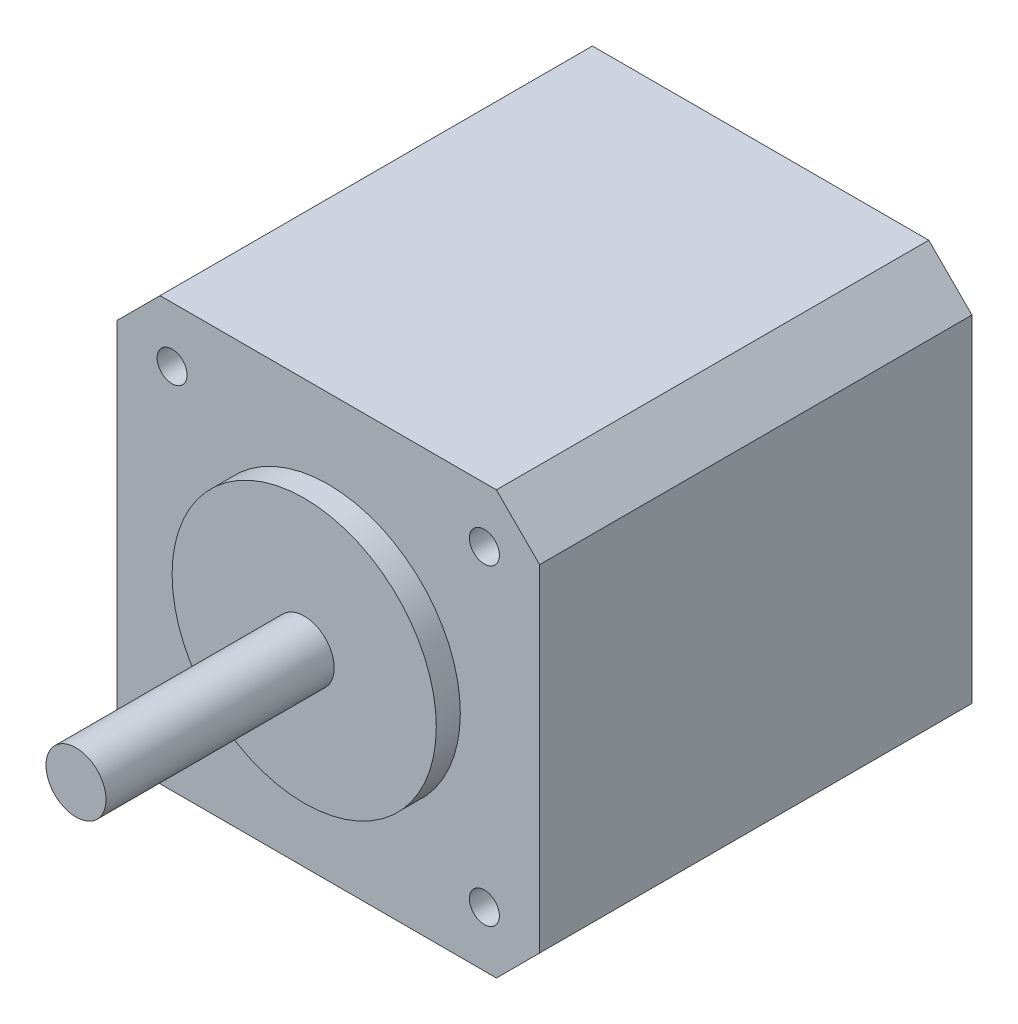
ISO-10303-21;
HEADER;
FILE_DESCRIPTION(('STEP AP214'),'2;1');
FILE_NAME('part.step','',(''),(''),'','','');
FILE_SCHEMA(('AUTOMOTIVE_DESIGN { 1 0 10303 214 1 1 1 1 }'));
ENDSEC;
DATA;
#1=APPLICATION_CONTEXT('core data for automotive mechanical design processes');
#2=APPLICATION_PROTOCOL_DEFINITION('international standard','automotive_design',2000,#1);
#3=PRODUCT_CONTEXT('',#1,'mechanical');
#4=PRODUCT('Part','Part','',(#3));
#5=PRODUCT_RELATED_PRODUCT_CATEGORY('part','',(#4));
#6=PRODUCT_DEFINITION_FORMATION('','',#4);
#7=PRODUCT_DEFINITION_CONTEXT('part definition',#1,'design');
#8=PRODUCT_DEFINITION('design','',#6,#7);
#9=PRODUCT_DEFINITION_SHAPE('','',#8);
#10=(LENGTH_UNIT() NAMED_UNIT(*) SI_UNIT(.MILLI.,.METRE.));
#11=(NAMED_UNIT(*) PLANE_ANGLE_UNIT() SI_UNIT($,.RADIAN.));
#12=(NAMED_UNIT(*) SI_UNIT($,.STERADIAN.) SOLID_ANGLE_UNIT());
#13=UNCERTAINTY_MEASURE_WITH_UNIT(LENGTH_MEASURE(1.E-05),#10,'distance_accuracy_value','');
#14=(GEOMETRIC_REPRESENTATION_CONTEXT(3) GLOBAL_UNCERTAINTY_ASSIGNED_CONTEXT((#13)) GLOBAL_UNIT_ASSIGNED_CONTEXT((#10,
#11,#12)) REPRESENTATION_CONTEXT('',''));
#15=CARTESIAN_POINT('',(0.,0.,0.));
#16=DIRECTION('',(0.,0.,1.));
#17=DIRECTION('',(1.,0.,0.));
#18=AXIS2_PLACEMENT_3D('',#15,#16,#17);
#19=CARTESIAN_POINT('',(0.,0.,2.));
#20=DIRECTION('',(0.,0.,1.));
#21=DIRECTION('',(1.,0.,0.));
#22=AXIS2_PLACEMENT_3D('',#19,#20,#21);
#23=PLANE('',#22);
#24=CARTESIAN_POINT('',(0.,0.,2.));
#25=DIRECTION('',(0.,0.,1.));
#26=DIRECTION('',(1.,0.,0.));
#27=AXIS2_PLACEMENT_3D('',#24,#25,#26);
#28=CIRCLE('',#27,11.);
#29=CARTESIAN_POINT('',(11.,0.,2.));
#30=VERTEX_POINT('',#29);
#31=EDGE_CURVE('E145',#30,#30,#28,.T.);
#32=ORIENTED_EDGE('',*,*,#31,.T.);
#33=EDGE_LOOP('',(#32));
#34=FACE_BOUND('',#33,.T.);
#35=CARTESIAN_POINT('',(0.,0.,2.));
#36=DIRECTION('',(0.,0.,1.));
#37=DIRECTION('',(1.,0.,0.));
#38=AXIS2_PLACEMENT_3D('',#35,#36,#37);
#39=CIRCLE('',#38,2.5);
#40=CARTESIAN_POINT('',(2.5,0.,2.));
#41=VERTEX_POINT('',#40);
#42=EDGE_CURVE('E42',#41,#41,#39,.F.);
#43=ORIENTED_EDGE('',*,*,#42,.T.);
#44=EDGE_LOOP('',(#43));
#45=FACE_BOUND('',#44,.T.);
#46=ADVANCED_FACE('F38',(#34,#45),#23,.T.);
#47=CARTESIAN_POINT('',(0.,0.,0.));
#48=DIRECTION('',(0.,0.,-1.));
#49=DIRECTION('',(-1.,0.,0.));
#50=AXIS2_PLACEMENT_3D('',#47,#48,#49);
#51=PLANE('',#50);
#52=CARTESIAN_POINT('',(-13.,-13.,0.));
#53=DIRECTION('',(0.,0.,1.));
#54=DIRECTION('',(1.,0.,0.));
#55=AXIS2_PLACEMENT_3D('',#52,#53,#54);
#56=CIRCLE('',#55,1.24999999999999);
#57=CARTESIAN_POINT('',(-11.75,-13.,0.));
#58=VERTEX_POINT('',#57);
#59=EDGE_CURVE('E387',#58,#58,#56,.T.);
#60=ORIENTED_EDGE('',*,*,#59,.F.);
#61=EDGE_LOOP('',(#60));
#62=FACE_BOUND('',#61,.T.);
#63=CARTESIAN_POINT('',(13.,-13.,0.));
#64=DIRECTION('',(0.,0.,1.));
#65=DIRECTION('',(1.,0.,0.));
#66=AXIS2_PLACEMENT_3D('',#63,#64,#65);
#67=CIRCLE('',#66,1.24999999999999);
#68=CARTESIAN_POINT('',(14.25,-13.,0.));
#69=VERTEX_POINT('',#68);
#70=EDGE_CURVE('E389',#69,#69,#67,.T.);
#71=ORIENTED_EDGE('',*,*,#70,.F.);
#72=EDGE_LOOP('',(#71));
#73=FACE_BOUND('',#72,.T.);
#74=CARTESIAN_POINT('',(13.,13.,0.));
#75=DIRECTION('',(0.,0.,1.));
#76=DIRECTION('',(1.,0.,0.));
#77=AXIS2_PLACEMENT_3D('',#74,#75,#76);
#78=CIRCLE('',#77,1.24999999999999);
#79=CARTESIAN_POINT('',(14.25,13.,0.));
#80=VERTEX_POINT('',#79);
#81=EDGE_CURVE('E397',#80,#80,#78,.T.);
#82=ORIENTED_EDGE('',*,*,#81,.F.);
#83=EDGE_LOOP('',(#82));
#84=FACE_BOUND('',#83,.T.);
#85=CARTESIAN_POINT('',(-13.,13.,0.));
#86=DIRECTION('',(0.,0.,1.));
#87=DIRECTION('',(1.,0.,0.));
#88=AXIS2_PLACEMENT_3D('',#85,#86,#87);
#89=CIRCLE('',#88,1.24999999999999);
#90=CARTESIAN_POINT('',(-11.75,13.,0.));
#91=VERTEX_POINT('',#90);
#92=EDGE_CURVE('E403',#91,#91,#89,.T.);
#93=ORIENTED_EDGE('',*,*,#92,.F.);
#94=EDGE_LOOP('',(#93));
#95=FACE_BOUND('',#94,.T.);
#96=DIRECTION('',(-0.707106781186551,-0.707106781186544,0.));
#97=VECTOR('',#96,1.);
#98=CARTESIAN_POINT('',(-14.0038057516332,17.6,0.));
#99=LINE('',#98,#97);
#100=CARTESIAN_POINT('',(-14.0038057516332,17.6,0.));
#101=VERTEX_POINT('',#100);
#102=CARTESIAN_POINT('',(-17.6,14.0038057516332,0.));
#103=VERTEX_POINT('',#102);
#104=EDGE_CURVE('E141',#101,#103,#99,.T.);
#105=ORIENTED_EDGE('',*,*,#104,.T.);
#106=DIRECTION('',(0.,-1.,0.));
#107=VECTOR('',#106,1.);
#108=CARTESIAN_POINT('',(-17.6,-14.0038057516332,0.));
#109=LINE('',#108,#107);
#110=CARTESIAN_POINT('',(-17.6,-14.0038057516332,0.));
#111=VERTEX_POINT('',#110);
#112=EDGE_CURVE('E144',#103,#111,#109,.T.);
#113=ORIENTED_EDGE('',*,*,#112,.T.);
#114=DIRECTION('',(0.707106781186547,-0.707106781186548,0.));
#115=VECTOR('',#114,1.);
#116=CARTESIAN_POINT('',(-14.0038057516332,-17.6,0.));
#117=LINE('',#116,#115);
#118=CARTESIAN_POINT('',(-14.0038057516332,-17.6,0.));
#119=VERTEX_POINT('',#118);
#120=EDGE_CURVE('E148',#111,#119,#117,.T.);
#121=ORIENTED_EDGE('',*,*,#120,.T.);
#122=DIRECTION('',(1.,0.,0.));
#123=VECTOR('',#122,1.);
#124=CARTESIAN_POINT('',(-14.0038057516332,-17.6,0.));
#125=LINE('',#124,#123);
#126=CARTESIAN_POINT('',(14.0038057516332,-17.6,0.));
#127=VERTEX_POINT('',#126);
#128=EDGE_CURVE('E151',#119,#127,#125,.T.);
#129=ORIENTED_EDGE('',*,*,#128,.T.);
#130=DIRECTION('',(0.707106781186549,0.707106781186546,0.));
#131=VECTOR('',#130,1.);
#132=CARTESIAN_POINT('',(14.0038057516332,-17.6,0.));
#133=LINE('',#132,#131);
#134=CARTESIAN_POINT('',(17.6,-14.0038057516332,0.));
#135=VERTEX_POINT('',#134);
#136=EDGE_CURVE('E154',#127,#135,#133,.T.);
#137=ORIENTED_EDGE('',*,*,#136,.T.);
#138=DIRECTION('',(0.,1.,0.));
#139=VECTOR('',#138,1.);
#140=CARTESIAN_POINT('',(17.6,-14.0038057516332,0.));
#141=LINE('',#140,#139);
#142=CARTESIAN_POINT('',(17.6,14.0038057516332,0.));
#143=VERTEX_POINT('',#142);
#144=EDGE_CURVE('E157',#135,#143,#141,.T.);
#145=ORIENTED_EDGE('',*,*,#144,.T.);
#146=DIRECTION('',(-0.707106781186548,0.707106781186547,0.));
#147=VECTOR('',#146,1.);
#148=CARTESIAN_POINT('',(14.0038057516332,17.6,0.));
#149=LINE('',#148,#147);
#150=CARTESIAN_POINT('',(14.0038057516332,17.6,0.));
#151=VERTEX_POINT('',#150);
#152=EDGE_CURVE('E118',#143,#151,#149,.T.);
#153=ORIENTED_EDGE('',*,*,#152,.T.);
#154=DIRECTION('',(-1.,0.,0.));
#155=VECTOR('',#154,1.);
#156=CARTESIAN_POINT('',(-14.0038057516332,17.6,0.));
#157=LINE('',#156,#155);
#158=EDGE_CURVE('E160',#151,#101,#157,.T.);
#159=ORIENTED_EDGE('',*,*,#158,.T.);
#160=EDGE_LOOP('',(#105,#113,#121,#129,#137,#145,#153,#159));
#161=FACE_BOUND('',#160,.T.);
#162=CARTESIAN_POINT('',(0.,0.,0.));
#163=DIRECTION('',(0.,0.,-1.));
#164=DIRECTION('',(-1.,0.,0.));
#165=AXIS2_PLACEMENT_3D('',#162,#163,#164);
#166=CIRCLE('',#165,11.);
#167=CARTESIAN_POINT('',(-11.,0.,0.));
#168=VERTEX_POINT('',#167);
#169=EDGE_CURVE('E11',#168,#168,#166,.F.);
#170=ORIENTED_EDGE('',*,*,#169,.F.);
#171=EDGE_LOOP('',(#170));
#172=FACE_BOUND('',#171,.T.);
#173=ADVANCED_FACE('F176',(#62,#73,#84,#95,#161,#172),#51,.F.);
#174=CARTESIAN_POINT('',(-14.0038057516332,17.6,-36.));
#175=DIRECTION('',(-0.707106781186544,0.707106781186551,0.));
#176=DIRECTION('',(-0.707106781186551,-0.707106781186544,0.));
#177=AXIS2_PLACEMENT_3D('',#174,#175,#176);
#178=PLANE('',#177);
#179=ORIENTED_EDGE('',*,*,#104,.F.);
#180=DIRECTION('',(0.,0.,1.));
#181=VECTOR('',#180,1.);
#182=CARTESIAN_POINT('',(-14.0038057516332,17.6,-36.));
#183=LINE('',#182,#181);
#184=CARTESIAN_POINT('',(-14.0038057516332,17.6,-36.));
#185=VERTEX_POINT('',#184);
#186=EDGE_CURVE('E48',#185,#101,#183,.T.);
#187=ORIENTED_EDGE('',*,*,#186,.F.);
#188=DIRECTION('',(-0.707106781186551,-0.707106781186544,0.));
#189=VECTOR('',#188,1.);
#190=CARTESIAN_POINT('',(-14.0038057516332,17.6,-36.));
#191=LINE('',#190,#189);
#192=CARTESIAN_POINT('',(-17.6,14.0038057516332,-36.));
#193=VERTEX_POINT('',#192);
#194=EDGE_CURVE('E163',#185,#193,#191,.T.);
#195=ORIENTED_EDGE('',*,*,#194,.T.);
#196=DIRECTION('',(0.,0.,1.));
#197=VECTOR('',#196,1.);
#198=CARTESIAN_POINT('',(-17.6,14.0038057516332,-36.));
#199=LINE('',#198,#197);
#200=EDGE_CURVE('E97',#193,#103,#199,.T.);
#201=ORIENTED_EDGE('',*,*,#200,.T.);
#202=EDGE_LOOP('',(#179,#187,#195,#201));
#203=FACE_BOUND('',#202,.T.);
#204=ADVANCED_FACE('F40',(#203),#178,.T.);
#205=CARTESIAN_POINT('',(-14.0038057516332,17.6,-36.));
#206=DIRECTION('',(0.,1.,0.));
#207=DIRECTION('',(-1.,0.,0.));
#208=AXIS2_PLACEMENT_3D('',#205,#206,#207);
#209=PLANE('',#208);
#210=ORIENTED_EDGE('',*,*,#158,.F.);
#211=DIRECTION('',(0.,0.,1.));
#212=VECTOR('',#211,1.);
#213=CARTESIAN_POINT('',(14.0038057516332,17.6,-36.));
#214=LINE('',#213,#212);
#215=CARTESIAN_POINT('',(14.0038057516332,17.6,-36.));
#216=VERTEX_POINT('',#215);
#217=EDGE_CURVE('E85',#216,#151,#214,.T.);
#218=ORIENTED_EDGE('',*,*,#217,.F.);
#219=DIRECTION('',(-1.,0.,0.));
#220=VECTOR('',#219,1.);
#221=CARTESIAN_POINT('',(-14.0038057516332,17.6,-36.));
#222=LINE('',#221,#220);
#223=EDGE_CURVE('E131',#216,#185,#222,.T.);
#224=ORIENTED_EDGE('',*,*,#223,.T.);
#225=ORIENTED_EDGE('',*,*,#186,.T.);
#226=EDGE_LOOP('',(#210,#218,#224,#225));
#227=FACE_BOUND('',#226,.T.);
#228=ADVANCED_FACE('F178',(#227),#209,.T.);
#229=CARTESIAN_POINT('',(14.0038057516332,17.6,-36.));
#230=DIRECTION('',(0.707106781186547,0.707106781186548,0.));
#231=DIRECTION('',(-0.707106781186548,0.707106781186547,0.));
#232=AXIS2_PLACEMENT_3D('',#229,#230,#231);
#233=PLANE('',#232);
#234=ORIENTED_EDGE('',*,*,#152,.F.);
#235=DIRECTION('',(0.,0.,1.));
#236=VECTOR('',#235,1.);
#237=CARTESIAN_POINT('',(17.6,14.0038057516332,-36.));
#238=LINE('',#237,#236);
#239=CARTESIAN_POINT('',(17.6,14.0038057516332,-36.));
#240=VERTEX_POINT('',#239);
#241=EDGE_CURVE('E113',#240,#143,#238,.T.);
#242=ORIENTED_EDGE('',*,*,#241,.F.);
#243=DIRECTION('',(-0.707106781186548,0.707106781186547,0.));
#244=VECTOR('',#243,1.);
#245=CARTESIAN_POINT('',(14.0038057516332,17.6,-36.));
#246=LINE('',#245,#244);
#247=EDGE_CURVE('E116',#240,#216,#246,.T.);
#248=ORIENTED_EDGE('',*,*,#247,.T.);
#249=ORIENTED_EDGE('',*,*,#217,.T.);
#250=EDGE_LOOP('',(#234,#242,#248,#249));
#251=FACE_BOUND('',#250,.T.);
#252=ADVANCED_FACE('F115',(#251),#233,.T.);
#253=CARTESIAN_POINT('',(17.6,-14.0038057516332,-36.));
#254=DIRECTION('',(1.,0.,0.));
#255=DIRECTION('',(0.,1.,0.));
#256=AXIS2_PLACEMENT_3D('',#253,#254,#255);
#257=PLANE('',#256);
#258=ORIENTED_EDGE('',*,*,#144,.F.);
#259=DIRECTION('',(0.,0.,1.));
#260=VECTOR('',#259,1.);
#261=CARTESIAN_POINT('',(17.6,-14.0038057516332,-36.));
#262=LINE('',#261,#260);
#263=CARTESIAN_POINT('',(17.6,-14.0038057516332,-36.));
#264=VERTEX_POINT('',#263);
#265=EDGE_CURVE('E123',#264,#135,#262,.T.);
#266=ORIENTED_EDGE('',*,*,#265,.F.);
#267=DIRECTION('',(0.,1.,0.));
#268=VECTOR('',#267,1.);
#269=CARTESIAN_POINT('',(17.6,-14.0038057516332,-36.));
#270=LINE('',#269,#268);
#271=EDGE_CURVE('E129',#264,#240,#270,.T.);
#272=ORIENTED_EDGE('',*,*,#271,.T.);
#273=ORIENTED_EDGE('',*,*,#241,.T.);
#274=EDGE_LOOP('',(#258,#266,#272,#273));
#275=FACE_BOUND('',#274,.T.);
#276=ADVANCED_FACE('F133',(#275),#257,.T.);
#277=CARTESIAN_POINT('',(14.0038057516332,-17.6,-36.));
#278=DIRECTION('',(0.707106781186546,-0.707106781186549,0.));
#279=DIRECTION('',(0.707106781186549,0.707106781186546,0.));
#280=AXIS2_PLACEMENT_3D('',#277,#278,#279);
#281=PLANE('',#280);
#282=ORIENTED_EDGE('',*,*,#136,.F.);
#283=DIRECTION('',(0.,0.,1.));
#284=VECTOR('',#283,1.);
#285=CARTESIAN_POINT('',(14.0038057516332,-17.6,-36.));
#286=LINE('',#285,#284);
#287=CARTESIAN_POINT('',(14.0038057516332,-17.6,-36.));
#288=VERTEX_POINT('',#287);
#289=EDGE_CURVE('E167',#288,#127,#286,.T.);
#290=ORIENTED_EDGE('',*,*,#289,.F.);
#291=DIRECTION('',(0.707106781186549,0.707106781186546,0.));
#292=VECTOR('',#291,1.);
#293=CARTESIAN_POINT('',(14.0038057516332,-17.6,-36.));
#294=LINE('',#293,#292);
#295=EDGE_CURVE('E134',#288,#264,#294,.T.);
#296=ORIENTED_EDGE('',*,*,#295,.T.);
#297=ORIENTED_EDGE('',*,*,#265,.T.);
#298=EDGE_LOOP('',(#282,#290,#296,#297));
#299=FACE_BOUND('',#298,.T.);
#300=ADVANCED_FACE('F218',(#299),#281,.T.);
#301=CARTESIAN_POINT('',(-14.0038057516332,-17.6,-36.));
#302=DIRECTION('',(0.,-1.,0.));
#303=DIRECTION('',(1.,0.,0.));
#304=AXIS2_PLACEMENT_3D('',#301,#302,#303);
#305=PLANE('',#304);
#306=ORIENTED_EDGE('',*,*,#128,.F.);
#307=DIRECTION('',(0.,0.,1.));
#308=VECTOR('',#307,1.);
#309=CARTESIAN_POINT('',(-14.0038057516332,-17.6,-36.));
#310=LINE('',#309,#308);
#311=CARTESIAN_POINT('',(-14.0038057516332,-17.6,-36.));
#312=VERTEX_POINT('',#311);
#313=EDGE_CURVE('E169',#312,#119,#310,.T.);
#314=ORIENTED_EDGE('',*,*,#313,.F.);
#315=DIRECTION('',(1.,0.,0.));
#316=VECTOR('',#315,1.);
#317=CARTESIAN_POINT('',(-14.0038057516332,-17.6,-36.));
#318=LINE('',#317,#316);
#319=EDGE_CURVE('E136',#312,#288,#318,.T.);
#320=ORIENTED_EDGE('',*,*,#319,.T.);
#321=ORIENTED_EDGE('',*,*,#289,.T.);
#322=EDGE_LOOP('',(#306,#314,#320,#321));
#323=FACE_BOUND('',#322,.T.);
#324=ADVANCED_FACE('F212',(#323),#305,.T.);
#325=CARTESIAN_POINT('',(-14.0038057516332,-17.6,-36.));
#326=DIRECTION('',(-0.707106781186548,-0.707106781186547,0.));
#327=DIRECTION('',(0.707106781186547,-0.707106781186548,0.));
#328=AXIS2_PLACEMENT_3D('',#325,#326,#327);
#329=PLANE('',#328);
#330=ORIENTED_EDGE('',*,*,#120,.F.);
#331=DIRECTION('',(0.,0.,1.));
#332=VECTOR('',#331,1.);
#333=CARTESIAN_POINT('',(-17.6,-14.0038057516332,-36.));
#334=LINE('',#333,#332);
#335=CARTESIAN_POINT('',(-17.6,-14.0038057516332,-36.));
#336=VERTEX_POINT('',#335);
#337=EDGE_CURVE('E171',#336,#111,#334,.T.);
#338=ORIENTED_EDGE('',*,*,#337,.F.);
#339=DIRECTION('',(0.707106781186547,-0.707106781186548,0.));
#340=VECTOR('',#339,1.);
#341=CARTESIAN_POINT('',(-14.0038057516332,-17.6,-36.));
#342=LINE('',#341,#340);
#343=EDGE_CURVE('E416',#336,#312,#342,.T.);
#344=ORIENTED_EDGE('',*,*,#343,.T.);
#345=ORIENTED_EDGE('',*,*,#313,.T.);
#346=EDGE_LOOP('',(#330,#338,#344,#345));
#347=FACE_BOUND('',#346,.T.);
#348=ADVANCED_FACE('F208',(#347),#329,.T.);
#349=CARTESIAN_POINT('',(-17.6,-14.0038057516332,-36.));
#350=DIRECTION('',(-1.,0.,0.));
#351=DIRECTION('',(0.,-1.,0.));
#352=AXIS2_PLACEMENT_3D('',#349,#350,#351);
#353=PLANE('',#352);
#354=ORIENTED_EDGE('',*,*,#112,.F.);
#355=ORIENTED_EDGE('',*,*,#200,.F.);
#356=DIRECTION('',(0.,-1.,0.));
#357=VECTOR('',#356,1.);
#358=CARTESIAN_POINT('',(-17.6,-14.0038057516332,-36.));
#359=LINE('',#358,#357);
#360=EDGE_CURVE('E414',#193,#336,#359,.T.);
#361=ORIENTED_EDGE('',*,*,#360,.T.);
#362=ORIENTED_EDGE('',*,*,#337,.T.);
#363=EDGE_LOOP('',(#354,#355,#361,#362));
#364=FACE_BOUND('',#363,.T.);
#365=ADVANCED_FACE('F173',(#364),#353,.T.);
#366=CARTESIAN_POINT('',(0.,0.,-36.));
#367=DIRECTION('',(0.,0.,-1.));
#368=DIRECTION('',(-1.,0.,0.));
#369=AXIS2_PLACEMENT_3D('',#366,#367,#368);
#370=PLANE('',#369);
#371=ORIENTED_EDGE('',*,*,#194,.F.);
#372=ORIENTED_EDGE('',*,*,#223,.F.);
#373=ORIENTED_EDGE('',*,*,#247,.F.);
#374=ORIENTED_EDGE('',*,*,#271,.F.);
#375=ORIENTED_EDGE('',*,*,#295,.F.);
#376=ORIENTED_EDGE('',*,*,#319,.F.);
#377=ORIENTED_EDGE('',*,*,#343,.F.);
#378=ORIENTED_EDGE('',*,*,#360,.F.);
#379=EDGE_LOOP('',(#371,#372,#373,#374,#375,#376,#377,#378));
#380=FACE_BOUND('',#379,.T.);
#381=ADVANCED_FACE('F127',(#380),#370,.T.);
#382=CARTESIAN_POINT('',(0.,0.,2.));
#383=DIRECTION('',(0.,0.,-1.));
#384=DIRECTION('',(-1.,0.,0.));
#385=AXIS2_PLACEMENT_3D('',#382,#383,#384);
#386=CYLINDRICAL_SURFACE('',#385,11.);
#387=ORIENTED_EDGE('',*,*,#31,.F.);
#388=EDGE_LOOP('',(#387));
#389=FACE_BOUND('',#388,.T.);
#390=ORIENTED_EDGE('',*,*,#169,.T.);
#391=EDGE_LOOP('',(#390));
#392=FACE_BOUND('',#391,.T.);
#393=ADVANCED_FACE('F200',(#389,#392),#386,.T.);
#394=CARTESIAN_POINT('',(0.,0.,21.));
#395=DIRECTION('',(0.,0.,-1.));
#396=DIRECTION('',(-1.,0.,0.));
#397=AXIS2_PLACEMENT_3D('',#394,#395,#396);
#398=CYLINDRICAL_SURFACE('',#397,2.5);
#399=ORIENTED_EDGE('',*,*,#42,.F.);
#400=EDGE_LOOP('',(#399));
#401=FACE_BOUND('',#400,.T.);
#402=CARTESIAN_POINT('',(0.,0.,21.));
#403=DIRECTION('',(0.,0.,1.));
#404=DIRECTION('',(1.,0.,0.));
#405=AXIS2_PLACEMENT_3D('',#402,#403,#404);
#406=CIRCLE('',#405,2.5);
#407=CARTESIAN_POINT('',(2.5,0.,21.));
#408=VERTEX_POINT('',#407);
#409=EDGE_CURVE('E409',#408,#408,#406,.T.);
#410=ORIENTED_EDGE('',*,*,#409,.F.);
#411=EDGE_LOOP('',(#410));
#412=FACE_BOUND('',#411,.T.);
#413=ADVANCED_FACE('F198',(#401,#412),#398,.T.);
#414=CARTESIAN_POINT('',(0.,0.,21.));
#415=DIRECTION('',(0.,0.,1.));
#416=DIRECTION('',(1.,0.,0.));
#417=AXIS2_PLACEMENT_3D('',#414,#415,#416);
#418=PLANE('',#417);
#419=ORIENTED_EDGE('',*,*,#409,.T.);
#420=EDGE_LOOP('',(#419));
#421=FACE_BOUND('',#420,.T.);
#422=ADVANCED_FACE('F268',(#421),#418,.T.);
#423=CARTESIAN_POINT('',(-13.,13.,-5.));
#424=DIRECTION('',(0.,0.,1.));
#425=DIRECTION('',(1.,0.,0.));
#426=AXIS2_PLACEMENT_3D('',#423,#424,#425);
#427=CONICAL_SURFACE('',#426,1.25,1.02974425867665);
#428=CARTESIAN_POINT('',(-13.,13.,-5.75107577378445));
#429=VERTEX_POINT('',#428);
#430=VERTEX_LOOP('',#429);
#431=FACE_BOUND('',#430,.T.);
#432=CARTESIAN_POINT('',(-13.,13.,-5.));
#433=DIRECTION('',(0.,0.,1.));
#434=DIRECTION('',(1.,0.,0.));
#435=AXIS2_PLACEMENT_3D('',#432,#433,#434);
#436=CIRCLE('',#435,1.25);
#437=CARTESIAN_POINT('',(-11.75,13.,-5.));
#438=VERTEX_POINT('',#437);
#439=EDGE_CURVE('E406',#438,#438,#436,.T.);
#440=ORIENTED_EDGE('',*,*,#439,.T.);
#441=EDGE_LOOP('',(#440));
#442=FACE_BOUND('',#441,.T.);
#443=ADVANCED_FACE('F277',(#431,#442),#427,.F.);
#444=CARTESIAN_POINT('',(-13.,13.,0.));
#445=DIRECTION('',(0.,0.,1.));
#446=DIRECTION('',(1.,0.,0.));
#447=AXIS2_PLACEMENT_3D('',#444,#445,#446);
#448=CYLINDRICAL_SURFACE('',#447,1.24999999999999);
#449=ORIENTED_EDGE('',*,*,#439,.F.);
#450=EDGE_LOOP('',(#449));
#451=FACE_BOUND('',#450,.T.);
#452=ORIENTED_EDGE('',*,*,#92,.T.);
#453=EDGE_LOOP('',(#452));
#454=FACE_BOUND('',#453,.T.);
#455=ADVANCED_FACE('F291',(#451,#454),#448,.F.);
#456=CARTESIAN_POINT('',(13.,13.,-5.));
#457=DIRECTION('',(0.,0.,1.));
#458=DIRECTION('',(1.,0.,0.));
#459=AXIS2_PLACEMENT_3D('',#456,#457,#458);
#460=CONICAL_SURFACE('',#459,1.25,1.02974425867665);
#461=CARTESIAN_POINT('',(13.,13.,-5.75107577378445));
#462=VERTEX_POINT('',#461);
#463=VERTEX_LOOP('',#462);
#464=FACE_BOUND('',#463,.T.);
#465=CARTESIAN_POINT('',(13.,13.,-5.));
#466=DIRECTION('',(0.,0.,1.));
#467=DIRECTION('',(1.,0.,0.));
#468=AXIS2_PLACEMENT_3D('',#465,#466,#467);
#469=CIRCLE('',#468,1.25);
#470=CARTESIAN_POINT('',(14.25,13.,-5.));
#471=VERTEX_POINT('',#470);
#472=EDGE_CURVE('E400',#471,#471,#469,.T.);
#473=ORIENTED_EDGE('',*,*,#472,.T.);
#474=EDGE_LOOP('',(#473));
#475=FACE_BOUND('',#474,.T.);
#476=ADVANCED_FACE('F302',(#464,#475),#460,.F.);
#477=CARTESIAN_POINT('',(13.,13.,0.));
#478=DIRECTION('',(0.,0.,1.));
#479=DIRECTION('',(1.,0.,0.));
#480=AXIS2_PLACEMENT_3D('',#477,#478,#479);
#481=CYLINDRICAL_SURFACE('',#480,1.24999999999999);
#482=ORIENTED_EDGE('',*,*,#472,.F.);
#483=EDGE_LOOP('',(#482));
#484=FACE_BOUND('',#483,.T.);
#485=ORIENTED_EDGE('',*,*,#81,.T.);
#486=EDGE_LOOP('',(#485));
#487=FACE_BOUND('',#486,.T.);
#488=ADVANCED_FACE('F314',(#484,#487),#481,.F.);
#489=CARTESIAN_POINT('',(13.,-13.,-5.));
#490=DIRECTION('',(0.,0.,1.));
#491=DIRECTION('',(1.,0.,0.));
#492=AXIS2_PLACEMENT_3D('',#489,#490,#491);
#493=CONICAL_SURFACE('',#492,1.25,1.02974425867665);
#494=CARTESIAN_POINT('',(13.,-13.,-5.75107577378445));
#495=VERTEX_POINT('',#494);
#496=VERTEX_LOOP('',#495);
#497=FACE_BOUND('',#496,.T.);
#498=CARTESIAN_POINT('',(13.,-13.,-5.));
#499=DIRECTION('',(0.,0.,1.));
#500=DIRECTION('',(1.,0.,0.));
#501=AXIS2_PLACEMENT_3D('',#498,#499,#500);
#502=CIRCLE('',#501,1.25);
#503=CARTESIAN_POINT('',(14.25,-13.,-5.));
#504=VERTEX_POINT('',#503);
#505=EDGE_CURVE('E394',#504,#504,#502,.T.);
#506=ORIENTED_EDGE('',*,*,#505,.T.);
#507=EDGE_LOOP('',(#506));
#508=FACE_BOUND('',#507,.T.);
#509=ADVANCED_FACE('F324',(#497,#508),#493,.F.);
#510=CARTESIAN_POINT('',(13.,-13.,0.));
#511=DIRECTION('',(0.,0.,1.));
#512=DIRECTION('',(1.,0.,0.));
#513=AXIS2_PLACEMENT_3D('',#510,#511,#512);
#514=CYLINDRICAL_SURFACE('',#513,1.24999999999999);
#515=ORIENTED_EDGE('',*,*,#505,.F.);
#516=EDGE_LOOP('',(#515));
#517=FACE_BOUND('',#516,.T.);
#518=ORIENTED_EDGE('',*,*,#70,.T.);
#519=EDGE_LOOP('',(#518));
#520=FACE_BOUND('',#519,.T.);
#521=ADVANCED_FACE('F336',(#517,#520),#514,.F.);
#522=CARTESIAN_POINT('',(-13.,-13.,-5.));
#523=DIRECTION('',(0.,0.,1.));
#524=DIRECTION('',(1.,0.,0.));
#525=AXIS2_PLACEMENT_3D('',#522,#523,#524);
#526=CONICAL_SURFACE('',#525,1.25,1.02974425867665);
#527=CARTESIAN_POINT('',(-13.,-13.,-5.75107577378445));
#528=VERTEX_POINT('',#527);
#529=VERTEX_LOOP('',#528);
#530=FACE_BOUND('',#529,.T.);
#531=CARTESIAN_POINT('',(-13.,-13.,-5.));
#532=DIRECTION('',(0.,0.,1.));
#533=DIRECTION('',(1.,0.,0.));
#534=AXIS2_PLACEMENT_3D('',#531,#532,#533);
#535=CIRCLE('',#534,1.25);
#536=CARTESIAN_POINT('',(-11.75,-13.,-5.));
#537=VERTEX_POINT('',#536);
#538=EDGE_CURVE('E384',#537,#537,#535,.T.);
#539=ORIENTED_EDGE('',*,*,#538,.T.);
#540=EDGE_LOOP('',(#539));
#541=FACE_BOUND('',#540,.T.);
#542=ADVANCED_FACE('F346',(#530,#541),#526,.F.);
#543=CARTESIAN_POINT('',(-13.,-13.,0.));
#544=DIRECTION('',(0.,0.,1.));
#545=DIRECTION('',(1.,0.,0.));
#546=AXIS2_PLACEMENT_3D('',#543,#544,#545);
#547=CYLINDRICAL_SURFACE('',#546,1.24999999999999);
#548=ORIENTED_EDGE('',*,*,#538,.F.);
#549=EDGE_LOOP('',(#548));
#550=FACE_BOUND('',#549,.T.);
#551=ORIENTED_EDGE('',*,*,#59,.T.);
#552=EDGE_LOOP('',(#551));
#553=FACE_BOUND('',#552,.T.);
#554=ADVANCED_FACE('F358',(#550,#553),#547,.F.);
#555=CLOSED_SHELL('',(#46,#173,#204,#228,#252,#276,#300,#324,#348,#365,#381,#393,#413,#422,#443,
#455,#476,#488,#509,#521,#542,#554));
#556=MANIFOLD_SOLID_BREP('B2',#555);
#557=ADVANCED_BREP_SHAPE_REPRESENTATION('',(#18,#556),#14);
#558=SHAPE_DEFINITION_REPRESENTATION(#9,#557);
ENDSEC;
END-ISO-10303-21;
